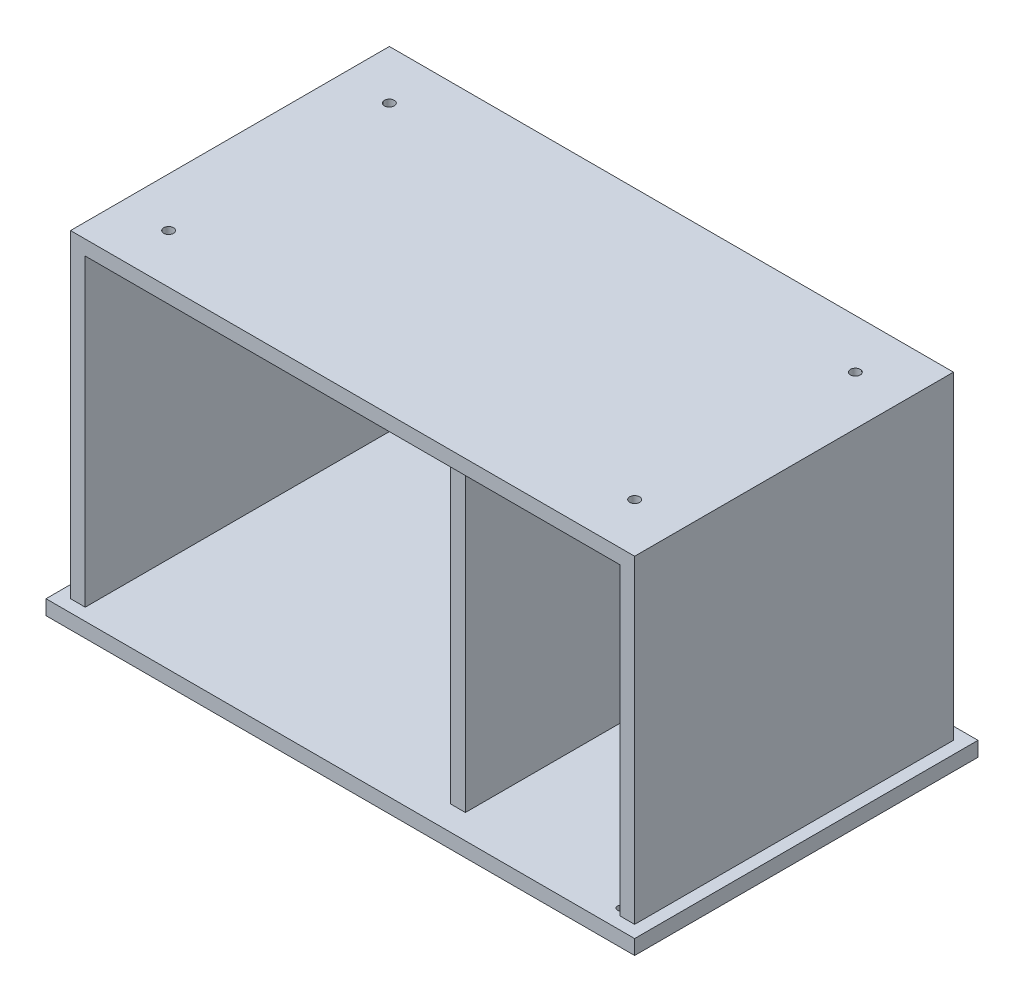
ISO-10303-21;
HEADER;
FILE_DESCRIPTION(('STEP AP214'),'2;1');
FILE_NAME('part.step','',(''),(''),'','','');
FILE_SCHEMA(('AUTOMOTIVE_DESIGN { 1 0 10303 214 1 1 1 1 }'));
ENDSEC;
DATA;
#1=APPLICATION_CONTEXT('core data for automotive mechanical design processes');
#2=APPLICATION_PROTOCOL_DEFINITION('international standard','automotive_design',2000,#1);
#3=PRODUCT_CONTEXT('',#1,'mechanical');
#4=PRODUCT('Part','Part','',(#3));
#5=PRODUCT_RELATED_PRODUCT_CATEGORY('part','',(#4));
#6=PRODUCT_DEFINITION_FORMATION('','',#4);
#7=PRODUCT_DEFINITION_CONTEXT('part definition',#1,'design');
#8=PRODUCT_DEFINITION('design','',#6,#7);
#9=PRODUCT_DEFINITION_SHAPE('','',#8);
#10=(LENGTH_UNIT() NAMED_UNIT(*) SI_UNIT(.MILLI.,.METRE.));
#11=(NAMED_UNIT(*) PLANE_ANGLE_UNIT() SI_UNIT($,.RADIAN.));
#12=(NAMED_UNIT(*) SI_UNIT($,.STERADIAN.) SOLID_ANGLE_UNIT());
#13=UNCERTAINTY_MEASURE_WITH_UNIT(LENGTH_MEASURE(1.E-05),#10,'distance_accuracy_value','');
#14=(GEOMETRIC_REPRESENTATION_CONTEXT(3) GLOBAL_UNCERTAINTY_ASSIGNED_CONTEXT((#13)) GLOBAL_UNIT_ASSIGNED_CONTEXT((#10,
#11,#12)) REPRESENTATION_CONTEXT('',''));
#15=CARTESIAN_POINT('',(0.,0.,0.));
#16=DIRECTION('',(0.,0.,1.));
#17=DIRECTION('',(1.,0.,0.));
#18=AXIS2_PLACEMENT_3D('',#15,#16,#17);
#19=CARTESIAN_POINT('',(0.,15.24,0.));
#20=DIRECTION('',(0.,1.,0.));
#21=DIRECTION('',(0.,0.,1.));
#22=AXIS2_PLACEMENT_3D('',#19,#20,#21);
#23=PLANE('',#22);
#24=CARTESIAN_POINT('',(575.31,15.24,-20.32));
#25=DIRECTION('',(0.,1.,0.));
#26=DIRECTION('',(0.,0.,1.));
#27=AXIS2_PLACEMENT_3D('',#24,#25,#26);
#28=CIRCLE('',#27,3.80999999999999);
#29=CARTESIAN_POINT('',(575.31,15.24,-16.51));
#30=VERTEX_POINT('',#29);
#31=EDGE_CURVE('E174',#30,#30,#28,.T.);
#32=ORIENTED_EDGE('',*,*,#31,.F.);
#33=EDGE_LOOP('',(#32));
#34=FACE_BOUND('',#33,.T.);
#35=DIRECTION('',(0.,0.,1.));
#36=VECTOR('',#35,1.);
#37=CARTESIAN_POINT('',(0.,15.24,-355.6));
#38=LINE('',#37,#36);
#39=CARTESIAN_POINT('',(0.,15.24,-355.6));
#40=VERTEX_POINT('',#39);
#41=CARTESIAN_POINT('',(0.,15.24,0.));
#42=VERTEX_POINT('',#41);
#43=EDGE_CURVE('E267',#40,#42,#38,.T.);
#44=ORIENTED_EDGE('',*,*,#43,.T.);
#45=DIRECTION('',(1.,0.,0.));
#46=VECTOR('',#45,1.);
#47=CARTESIAN_POINT('',(0.,15.24,0.));
#48=LINE('',#47,#46);
#49=CARTESIAN_POINT('',(609.6,15.24,0.));
#50=VERTEX_POINT('',#49);
#51=EDGE_CURVE('E270',#42,#50,#48,.T.);
#52=ORIENTED_EDGE('',*,*,#51,.T.);
#53=DIRECTION('',(0.,0.,-1.));
#54=VECTOR('',#53,1.);
#55=CARTESIAN_POINT('',(609.6,15.24,0.));
#56=LINE('',#55,#54);
#57=CARTESIAN_POINT('',(609.6,15.24,-355.6));
#58=VERTEX_POINT('',#57);
#59=EDGE_CURVE('E273',#50,#58,#56,.T.);
#60=ORIENTED_EDGE('',*,*,#59,.T.);
#61=DIRECTION('',(-1.,0.,0.));
#62=VECTOR('',#61,1.);
#63=CARTESIAN_POINT('',(609.6,15.24,-355.6));
#64=LINE('',#63,#62);
#65=EDGE_CURVE('E275',#58,#40,#64,.T.);
#66=ORIENTED_EDGE('',*,*,#65,.T.);
#67=EDGE_LOOP('',(#44,#52,#60,#66));
#68=FACE_BOUND('',#67,.T.);
#69=DIRECTION('',(0.,0.,1.));
#70=VECTOR('',#69,1.);
#71=CARTESIAN_POINT('',(581.66,15.24,-342.9));
#72=LINE('',#71,#70);
#73=CARTESIAN_POINT('',(581.66,15.24,-330.2));
#74=VERTEX_POINT('',#73);
#75=CARTESIAN_POINT('',(581.66,15.24,-12.7));
#76=VERTEX_POINT('',#75);
#77=EDGE_CURVE('E155',#74,#76,#72,.T.);
#78=ORIENTED_EDGE('',*,*,#77,.F.);
#79=DIRECTION('',(-1.,0.,0.));
#80=VECTOR('',#79,1.);
#81=CARTESIAN_POINT('',(12.7,15.24,-330.2));
#82=LINE('',#81,#80);
#83=CARTESIAN_POINT('',(408.94,15.24,-330.2));
#84=VERTEX_POINT('',#83);
#85=EDGE_CURVE('E165',#74,#84,#82,.T.);
#86=ORIENTED_EDGE('',*,*,#85,.T.);
#87=DIRECTION('',(0.,0.,1.));
#88=VECTOR('',#87,1.);
#89=CARTESIAN_POINT('',(408.94,15.24,-342.9));
#90=LINE('',#89,#88);
#91=CARTESIAN_POINT('',(408.94,15.24,-25.4));
#92=VERTEX_POINT('',#91);
#93=EDGE_CURVE('E199',#84,#92,#90,.T.);
#94=ORIENTED_EDGE('',*,*,#93,.T.);
#95=DIRECTION('',(1.,0.,0.));
#96=VECTOR('',#95,1.);
#97=CARTESIAN_POINT('',(408.94,15.24,-25.4));
#98=LINE('',#97,#96);
#99=CARTESIAN_POINT('',(393.7,15.24,-25.4));
#100=VERTEX_POINT('',#99);
#101=EDGE_CURVE('E185',#100,#92,#98,.T.);
#102=ORIENTED_EDGE('',*,*,#101,.F.);
#103=DIRECTION('',(0.,0.,1.));
#104=VECTOR('',#103,1.);
#105=CARTESIAN_POINT('',(393.7,15.24,-342.9));
#106=LINE('',#105,#104);
#107=CARTESIAN_POINT('',(393.7,15.24,-330.2));
#108=VERTEX_POINT('',#107);
#109=EDGE_CURVE('E210',#108,#100,#106,.T.);
#110=ORIENTED_EDGE('',*,*,#109,.F.);
#111=CARTESIAN_POINT('',(27.9400000000001,15.24,-330.2));
#112=VERTEX_POINT('',#111);
#113=EDGE_CURVE('E47',#108,#112,#82,.T.);
#114=ORIENTED_EDGE('',*,*,#113,.T.);
#115=DIRECTION('',(0.,0.,1.));
#116=VECTOR('',#115,1.);
#117=CARTESIAN_POINT('',(27.9400000000001,15.24,-342.9));
#118=LINE('',#117,#116);
#119=CARTESIAN_POINT('',(27.9400000000001,15.24,-12.7));
#120=VERTEX_POINT('',#119);
#121=EDGE_CURVE('E206',#112,#120,#118,.T.);
#122=ORIENTED_EDGE('',*,*,#121,.T.);
#123=DIRECTION('',(1.,0.,0.));
#124=VECTOR('',#123,1.);
#125=CARTESIAN_POINT('',(12.7000000000001,15.24,-12.7));
#126=LINE('',#125,#124);
#127=CARTESIAN_POINT('',(12.7000000000001,15.24,-12.7));
#128=VERTEX_POINT('',#127);
#129=EDGE_CURVE('E216',#128,#120,#126,.T.);
#130=ORIENTED_EDGE('',*,*,#129,.F.);
#131=DIRECTION('',(0.,0.,1.));
#132=VECTOR('',#131,1.);
#133=CARTESIAN_POINT('',(12.7,15.24,-342.9));
#134=LINE('',#133,#132);
#135=CARTESIAN_POINT('',(12.7,15.24,-342.9));
#136=VERTEX_POINT('',#135);
#137=EDGE_CURVE('E226',#136,#128,#134,.T.);
#138=ORIENTED_EDGE('',*,*,#137,.F.);
#139=DIRECTION('',(-1.,0.,0.));
#140=VECTOR('',#139,1.);
#141=CARTESIAN_POINT('',(12.7,15.24,-342.9));
#142=LINE('',#141,#140);
#143=CARTESIAN_POINT('',(596.9,15.24,-342.9));
#144=VERTEX_POINT('',#143);
#145=EDGE_CURVE('E224',#144,#136,#142,.T.);
#146=ORIENTED_EDGE('',*,*,#145,.F.);
#147=DIRECTION('',(0.,0.,-1.));
#148=VECTOR('',#147,1.);
#149=CARTESIAN_POINT('',(596.9,15.24,-342.9));
#150=LINE('',#149,#148);
#151=CARTESIAN_POINT('',(596.9,15.24,-12.7));
#152=VERTEX_POINT('',#151);
#153=EDGE_CURVE('E200',#152,#144,#150,.T.);
#154=ORIENTED_EDGE('',*,*,#153,.F.);
#155=EDGE_CURVE('E228',#76,#152,#126,.T.);
#156=ORIENTED_EDGE('',*,*,#155,.F.);
#157=EDGE_LOOP('',(#78,#86,#94,#102,#110,#114,#122,#130,#138,#146,#154,#156));
#158=FACE_BOUND('',#157,.T.);
#159=ADVANCED_FACE('F32',(#34,#68,#158),#23,.T.);
#160=CARTESIAN_POINT('',(27.9400000000001,330.2,-342.9));
#161=DIRECTION('',(-1.,0.,0.));
#162=DIRECTION('',(0.,-1.,0.));
#163=AXIS2_PLACEMENT_3D('',#160,#161,#162);
#164=PLANE('',#163);
#165=DIRECTION('',(0.,-1.,0.));
#166=VECTOR('',#165,1.);
#167=CARTESIAN_POINT('',(27.9400000000001,330.2,-330.2));
#168=LINE('',#167,#166);
#169=CARTESIAN_POINT('',(27.9400000000001,330.2,-330.2));
#170=VERTEX_POINT('',#169);
#171=EDGE_CURVE('E179',#170,#112,#168,.T.);
#172=ORIENTED_EDGE('',*,*,#171,.F.);
#173=DIRECTION('',(0.,0.,1.));
#174=VECTOR('',#173,1.);
#175=CARTESIAN_POINT('',(27.9400000000001,330.2,-342.9));
#176=LINE('',#175,#174);
#177=CARTESIAN_POINT('',(27.9400000000001,330.2,-12.7));
#178=VERTEX_POINT('',#177);
#179=EDGE_CURVE('E197',#170,#178,#176,.T.);
#180=ORIENTED_EDGE('',*,*,#179,.T.);
#181=DIRECTION('',(0.,-1.,0.));
#182=VECTOR('',#181,1.);
#183=CARTESIAN_POINT('',(27.9400000000001,330.2,-12.7));
#184=LINE('',#183,#182);
#185=EDGE_CURVE('E194',#178,#120,#184,.T.);
#186=ORIENTED_EDGE('',*,*,#185,.T.);
#187=ORIENTED_EDGE('',*,*,#121,.F.);
#188=EDGE_LOOP('',(#172,#180,#186,#187));
#189=FACE_BOUND('',#188,.T.);
#190=ADVANCED_FACE('F314',(#189),#164,.F.);
#191=CARTESIAN_POINT('',(393.7,330.2,-342.9));
#192=DIRECTION('',(1.,0.,0.));
#193=DIRECTION('',(0.,1.,0.));
#194=AXIS2_PLACEMENT_3D('',#191,#192,#193);
#195=PLANE('',#194);
#196=DIRECTION('',(0.,1.,0.));
#197=VECTOR('',#196,1.);
#198=CARTESIAN_POINT('',(393.7,330.2,-330.2));
#199=LINE('',#198,#197);
#200=CARTESIAN_POINT('',(393.7,330.2,-330.2));
#201=VERTEX_POINT('',#200);
#202=EDGE_CURVE('E55',#108,#201,#199,.T.);
#203=ORIENTED_EDGE('',*,*,#202,.F.);
#204=ORIENTED_EDGE('',*,*,#109,.T.);
#205=DIRECTION('',(0.,-1.,0.));
#206=VECTOR('',#205,1.);
#207=CARTESIAN_POINT('',(393.7,15.24,-25.4));
#208=LINE('',#207,#206);
#209=CARTESIAN_POINT('',(393.7,330.2,-25.4));
#210=VERTEX_POINT('',#209);
#211=EDGE_CURVE('E182',#210,#100,#208,.T.);
#212=ORIENTED_EDGE('',*,*,#211,.F.);
#213=DIRECTION('',(0.,0.,1.));
#214=VECTOR('',#213,1.);
#215=CARTESIAN_POINT('',(393.7,330.2,-342.9));
#216=LINE('',#215,#214);
#217=EDGE_CURVE('E208',#201,#210,#216,.T.);
#218=ORIENTED_EDGE('',*,*,#217,.F.);
#219=EDGE_LOOP('',(#203,#204,#212,#218));
#220=FACE_BOUND('',#219,.T.);
#221=ADVANCED_FACE('F353',(#220),#195,.F.);
#222=CARTESIAN_POINT('',(408.94,15.24,-342.9));
#223=DIRECTION('',(-1.,0.,0.));
#224=DIRECTION('',(0.,0.,1.));
#225=AXIS2_PLACEMENT_3D('',#222,#223,#224);
#226=PLANE('',#225);
#227=DIRECTION('',(0.,-1.,0.));
#228=VECTOR('',#227,1.);
#229=CARTESIAN_POINT('',(408.94,15.24,-330.2));
#230=LINE('',#229,#228);
#231=CARTESIAN_POINT('',(408.94,330.2,-330.2));
#232=VERTEX_POINT('',#231);
#233=EDGE_CURVE('E164',#232,#84,#230,.T.);
#234=ORIENTED_EDGE('',*,*,#233,.F.);
#235=DIRECTION('',(0.,0.,1.));
#236=VECTOR('',#235,1.);
#237=CARTESIAN_POINT('',(408.94,330.2,-342.9));
#238=LINE('',#237,#236);
#239=CARTESIAN_POINT('',(408.94,330.2,-25.4));
#240=VERTEX_POINT('',#239);
#241=EDGE_CURVE('E154',#232,#240,#238,.T.);
#242=ORIENTED_EDGE('',*,*,#241,.T.);
#243=DIRECTION('',(0.,1.,0.));
#244=VECTOR('',#243,1.);
#245=CARTESIAN_POINT('',(408.94,330.2,-25.4));
#246=LINE('',#245,#244);
#247=EDGE_CURVE('E188',#92,#240,#246,.T.);
#248=ORIENTED_EDGE('',*,*,#247,.F.);
#249=ORIENTED_EDGE('',*,*,#93,.F.);
#250=EDGE_LOOP('',(#234,#242,#248,#249));
#251=FACE_BOUND('',#250,.T.);
#252=ADVANCED_FACE('F347',(#251),#226,.F.);
#253=CARTESIAN_POINT('',(408.94,330.2,-342.9));
#254=DIRECTION('',(0.,1.,0.));
#255=DIRECTION('',(0.,0.,1.));
#256=AXIS2_PLACEMENT_3D('',#253,#254,#255);
#257=PLANE('',#256);
#258=CARTESIAN_POINT('',(575.31,330.2,-20.32));
#259=DIRECTION('',(0.,-1.,0.));
#260=DIRECTION('',(0.,0.,-1.));
#261=AXIS2_PLACEMENT_3D('',#258,#259,#260);
#262=CIRCLE('',#261,3.80999999999999);
#263=CARTESIAN_POINT('',(575.31,330.2,-24.13));
#264=VERTEX_POINT('',#263);
#265=EDGE_CURVE('E588',#264,#264,#262,.T.);
#266=ORIENTED_EDGE('',*,*,#265,.F.);
#267=EDGE_LOOP('',(#266));
#268=FACE_BOUND('',#267,.T.);
#269=DIRECTION('',(-1.,0.,0.));
#270=VECTOR('',#269,1.);
#271=CARTESIAN_POINT('',(408.94,330.2,-330.2));
#272=LINE('',#271,#270);
#273=CARTESIAN_POINT('',(581.66,330.2,-330.2));
#274=VERTEX_POINT('',#273);
#275=EDGE_CURVE('E159',#274,#232,#272,.T.);
#276=ORIENTED_EDGE('',*,*,#275,.F.);
#277=DIRECTION('',(0.,0.,1.));
#278=VECTOR('',#277,1.);
#279=CARTESIAN_POINT('',(581.66,330.2,-342.9));
#280=LINE('',#279,#278);
#281=CARTESIAN_POINT('',(581.66,330.2,-12.7));
#282=VERTEX_POINT('',#281);
#283=EDGE_CURVE('E145',#274,#282,#280,.T.);
#284=ORIENTED_EDGE('',*,*,#283,.T.);
#285=DIRECTION('',(-1.,0.,0.));
#286=VECTOR('',#285,1.);
#287=CARTESIAN_POINT('',(408.94,330.2,-12.7));
#288=LINE('',#287,#286);
#289=EDGE_CURVE('E196',#282,#178,#288,.T.);
#290=ORIENTED_EDGE('',*,*,#289,.T.);
#291=ORIENTED_EDGE('',*,*,#179,.F.);
#292=EDGE_CURVE('E167',#201,#170,#272,.T.);
#293=ORIENTED_EDGE('',*,*,#292,.F.);
#294=ORIENTED_EDGE('',*,*,#217,.T.);
#295=DIRECTION('',(-1.,0.,0.));
#296=VECTOR('',#295,1.);
#297=CARTESIAN_POINT('',(393.7,330.2,-25.4));
#298=LINE('',#297,#296);
#299=EDGE_CURVE('E191',#240,#210,#298,.T.);
#300=ORIENTED_EDGE('',*,*,#299,.F.);
#301=ORIENTED_EDGE('',*,*,#241,.F.);
#302=EDGE_LOOP('',(#276,#284,#290,#291,#293,#294,#300,#301));
#303=FACE_BOUND('',#302,.T.);
#304=ADVANCED_FACE('F160',(#268,#303),#257,.F.);
#305=CARTESIAN_POINT('',(581.66,15.24,-342.9));
#306=DIRECTION('',(1.,0.,0.));
#307=DIRECTION('',(0.,0.,-1.));
#308=AXIS2_PLACEMENT_3D('',#305,#306,#307);
#309=PLANE('',#308);
#310=DIRECTION('',(0.,1.,0.));
#311=VECTOR('',#310,1.);
#312=CARTESIAN_POINT('',(581.66,15.24,-330.2));
#313=LINE('',#312,#311);
#314=EDGE_CURVE('E11',#74,#274,#313,.T.);
#315=ORIENTED_EDGE('',*,*,#314,.F.);
#316=ORIENTED_EDGE('',*,*,#77,.T.);
#317=DIRECTION('',(0.,1.,0.));
#318=VECTOR('',#317,1.);
#319=CARTESIAN_POINT('',(581.66,15.24,-12.7));
#320=LINE('',#319,#318);
#321=EDGE_CURVE('E150',#76,#282,#320,.T.);
#322=ORIENTED_EDGE('',*,*,#321,.T.);
#323=ORIENTED_EDGE('',*,*,#283,.F.);
#324=EDGE_LOOP('',(#315,#316,#322,#323));
#325=FACE_BOUND('',#324,.T.);
#326=ADVANCED_FACE('F147',(#325),#309,.F.);
#327=CARTESIAN_POINT('',(0.,15.24,-355.6));
#328=DIRECTION('',(1.,0.,0.));
#329=DIRECTION('',(0.,0.,-1.));
#330=AXIS2_PLACEMENT_3D('',#327,#328,#329);
#331=PLANE('',#330);
#332=DIRECTION('',(0.,0.,1.));
#333=VECTOR('',#332,1.);
#334=CARTESIAN_POINT('',(0.,0.,-355.6));
#335=LINE('',#334,#333);
#336=CARTESIAN_POINT('',(0.,0.,-355.6));
#337=VERTEX_POINT('',#336);
#338=CARTESIAN_POINT('',(0.,0.,0.));
#339=VERTEX_POINT('',#338);
#340=EDGE_CURVE('E264',#337,#339,#335,.T.);
#341=ORIENTED_EDGE('',*,*,#340,.T.);
#342=DIRECTION('',(0.,-1.,0.));
#343=VECTOR('',#342,1.);
#344=CARTESIAN_POINT('',(0.,15.24,0.));
#345=LINE('',#344,#343);
#346=EDGE_CURVE('E40',#42,#339,#345,.T.);
#347=ORIENTED_EDGE('',*,*,#346,.F.);
#348=ORIENTED_EDGE('',*,*,#43,.F.);
#349=DIRECTION('',(0.,-1.,0.));
#350=VECTOR('',#349,1.);
#351=CARTESIAN_POINT('',(0.,15.24,-355.6));
#352=LINE('',#351,#350);
#353=EDGE_CURVE('E277',#40,#337,#352,.T.);
#354=ORIENTED_EDGE('',*,*,#353,.T.);
#355=EDGE_LOOP('',(#341,#347,#348,#354));
#356=FACE_BOUND('',#355,.T.);
#357=ADVANCED_FACE('F34',(#356),#331,.F.);
#358=CARTESIAN_POINT('',(0.,15.24,0.));
#359=DIRECTION('',(0.,0.,-1.));
#360=DIRECTION('',(-1.,0.,0.));
#361=AXIS2_PLACEMENT_3D('',#358,#359,#360);
#362=PLANE('',#361);
#363=DIRECTION('',(1.,0.,0.));
#364=VECTOR('',#363,1.);
#365=CARTESIAN_POINT('',(0.,0.,0.));
#366=LINE('',#365,#364);
#367=CARTESIAN_POINT('',(609.6,0.,0.));
#368=VERTEX_POINT('',#367);
#369=EDGE_CURVE('E280',#339,#368,#366,.T.);
#370=ORIENTED_EDGE('',*,*,#369,.T.);
#371=DIRECTION('',(0.,-1.,0.));
#372=VECTOR('',#371,1.);
#373=CARTESIAN_POINT('',(609.6,15.24,0.));
#374=LINE('',#373,#372);
#375=EDGE_CURVE('E290',#50,#368,#374,.T.);
#376=ORIENTED_EDGE('',*,*,#375,.F.);
#377=ORIENTED_EDGE('',*,*,#51,.F.);
#378=ORIENTED_EDGE('',*,*,#346,.T.);
#379=EDGE_LOOP('',(#370,#376,#377,#378));
#380=FACE_BOUND('',#379,.T.);
#381=ADVANCED_FACE('F295',(#380),#362,.F.);
#382=CARTESIAN_POINT('',(609.6,15.24,0.));
#383=DIRECTION('',(-1.,0.,0.));
#384=DIRECTION('',(0.,0.,1.));
#385=AXIS2_PLACEMENT_3D('',#382,#383,#384);
#386=PLANE('',#385);
#387=DIRECTION('',(0.,0.,-1.));
#388=VECTOR('',#387,1.);
#389=CARTESIAN_POINT('',(609.6,0.,0.));
#390=LINE('',#389,#388);
#391=CARTESIAN_POINT('',(609.6,0.,-355.6));
#392=VERTEX_POINT('',#391);
#393=EDGE_CURVE('E282',#368,#392,#390,.T.);
#394=ORIENTED_EDGE('',*,*,#393,.T.);
#395=DIRECTION('',(0.,-1.,0.));
#396=VECTOR('',#395,1.);
#397=CARTESIAN_POINT('',(609.6,15.24,-355.6));
#398=LINE('',#397,#396);
#399=EDGE_CURVE('E287',#58,#392,#398,.T.);
#400=ORIENTED_EDGE('',*,*,#399,.F.);
#401=ORIENTED_EDGE('',*,*,#59,.F.);
#402=ORIENTED_EDGE('',*,*,#375,.T.);
#403=EDGE_LOOP('',(#394,#400,#401,#402));
#404=FACE_BOUND('',#403,.T.);
#405=ADVANCED_FACE('F307',(#404),#386,.F.);
#406=CARTESIAN_POINT('',(609.6,15.24,-355.6));
#407=DIRECTION('',(0.,0.,1.));
#408=DIRECTION('',(1.,0.,0.));
#409=AXIS2_PLACEMENT_3D('',#406,#407,#408);
#410=PLANE('',#409);
#411=DIRECTION('',(-1.,0.,0.));
#412=VECTOR('',#411,1.);
#413=CARTESIAN_POINT('',(609.6,0.,-355.6));
#414=LINE('',#413,#412);
#415=EDGE_CURVE('E271',#392,#337,#414,.T.);
#416=ORIENTED_EDGE('',*,*,#415,.T.);
#417=ORIENTED_EDGE('',*,*,#353,.F.);
#418=ORIENTED_EDGE('',*,*,#65,.F.);
#419=ORIENTED_EDGE('',*,*,#399,.T.);
#420=EDGE_LOOP('',(#416,#417,#418,#419));
#421=FACE_BOUND('',#420,.T.);
#422=ADVANCED_FACE('F311',(#421),#410,.F.);
#423=CARTESIAN_POINT('',(0.,0.,0.));
#424=DIRECTION('',(0.,1.,0.));
#425=DIRECTION('',(0.,0.,1.));
#426=AXIS2_PLACEMENT_3D('',#423,#424,#425);
#427=PLANE('',#426);
#428=CARTESIAN_POINT('',(558.8,0.,-304.8));
#429=DIRECTION('',(0.,-1.,0.));
#430=DIRECTION('',(0.,0.,-1.));
#431=AXIS2_PLACEMENT_3D('',#428,#429,#430);
#432=CIRCLE('',#431,15.2400000000001);
#433=CARTESIAN_POINT('',(558.8,0.,-320.04));
#434=VERTEX_POINT('',#433);
#435=EDGE_CURVE('E253',#434,#434,#432,.T.);
#436=ORIENTED_EDGE('',*,*,#435,.F.);
#437=EDGE_LOOP('',(#436));
#438=FACE_BOUND('',#437,.T.);
#439=CARTESIAN_POINT('',(50.7999999999998,0.,-50.8000000000003));
#440=DIRECTION('',(0.,-1.,0.));
#441=DIRECTION('',(0.,0.,1.));
#442=AXIS2_PLACEMENT_3D('',#439,#440,#441);
#443=CIRCLE('',#442,15.24);
#444=CARTESIAN_POINT('',(50.7999999999998,0.,-35.5600000000003));
#445=VERTEX_POINT('',#444);
#446=EDGE_CURVE('E246',#445,#445,#443,.T.);
#447=ORIENTED_EDGE('',*,*,#446,.F.);
#448=EDGE_LOOP('',(#447));
#449=FACE_BOUND('',#448,.T.);
#450=CARTESIAN_POINT('',(50.8000000000001,0.,-304.8));
#451=DIRECTION('',(0.,-1.,0.));
#452=DIRECTION('',(0.,0.,1.));
#453=AXIS2_PLACEMENT_3D('',#450,#451,#452);
#454=CIRCLE('',#453,15.2400000000001);
#455=CARTESIAN_POINT('',(50.8000000000001,0.,-289.56));
#456=VERTEX_POINT('',#455);
#457=EDGE_CURVE('E242',#456,#456,#454,.T.);
#458=ORIENTED_EDGE('',*,*,#457,.F.);
#459=EDGE_LOOP('',(#458));
#460=FACE_BOUND('',#459,.T.);
#461=CARTESIAN_POINT('',(558.8,0.,-50.8));
#462=DIRECTION('',(0.,-1.,0.));
#463=DIRECTION('',(0.,0.,-1.));
#464=AXIS2_PLACEMENT_3D('',#461,#462,#463);
#465=CIRCLE('',#464,15.2400000000001);
#466=CARTESIAN_POINT('',(558.8,0.,-66.0400000000001));
#467=VERTEX_POINT('',#466);
#468=EDGE_CURVE('E252',#467,#467,#465,.T.);
#469=ORIENTED_EDGE('',*,*,#468,.F.);
#470=EDGE_LOOP('',(#469));
#471=FACE_BOUND('',#470,.T.);
#472=ORIENTED_EDGE('',*,*,#340,.F.);
#473=ORIENTED_EDGE('',*,*,#415,.F.);
#474=ORIENTED_EDGE('',*,*,#393,.F.);
#475=ORIENTED_EDGE('',*,*,#369,.F.);
#476=EDGE_LOOP('',(#472,#473,#474,#475));
#477=FACE_BOUND('',#476,.T.);
#478=ADVANCED_FACE('F303',(#438,#449,#460,#471,#477),#427,.F.);
#479=CARTESIAN_POINT('',(558.8,3.81,-50.8));
#480=DIRECTION('',(0.,-1.,0.));
#481=DIRECTION('',(0.,0.,-1.));
#482=AXIS2_PLACEMENT_3D('',#479,#480,#481);
#483=CYLINDRICAL_SURFACE('',#482,15.2400000000001);
#484=CARTESIAN_POINT('',(558.8,3.81,-50.8));
#485=DIRECTION('',(0.,-1.,0.));
#486=DIRECTION('',(0.,0.,-1.));
#487=AXIS2_PLACEMENT_3D('',#484,#485,#486);
#488=CIRCLE('',#487,15.2400000000001);
#489=CARTESIAN_POINT('',(558.8,3.81,-66.0400000000001));
#490=VERTEX_POINT('',#489);
#491=EDGE_CURVE('E261',#490,#490,#488,.T.);
#492=ORIENTED_EDGE('',*,*,#491,.F.);
#493=EDGE_LOOP('',(#492));
#494=FACE_BOUND('',#493,.T.);
#495=ORIENTED_EDGE('',*,*,#468,.T.);
#496=EDGE_LOOP('',(#495));
#497=FACE_BOUND('',#496,.T.);
#498=ADVANCED_FACE('F403',(#494,#497),#483,.F.);
#499=CARTESIAN_POINT('',(558.8,3.81,-50.8));
#500=DIRECTION('',(0.,-1.,0.));
#501=DIRECTION('',(0.,0.,-1.));
#502=AXIS2_PLACEMENT_3D('',#499,#500,#501);
#503=PLANE('',#502);
#504=ORIENTED_EDGE('',*,*,#491,.T.);
#505=EDGE_LOOP('',(#504));
#506=FACE_BOUND('',#505,.T.);
#507=ADVANCED_FACE('F385',(#506),#503,.T.);
#508=CARTESIAN_POINT('',(50.8000000000001,3.81,-304.8));
#509=DIRECTION('',(0.,-1.,0.));
#510=DIRECTION('',(0.,0.,-1.));
#511=AXIS2_PLACEMENT_3D('',#508,#509,#510);
#512=CYLINDRICAL_SURFACE('',#511,15.2400000000001);
#513=CARTESIAN_POINT('',(50.8000000000001,3.81,-304.8));
#514=DIRECTION('',(0.,-1.,0.));
#515=DIRECTION('',(0.,0.,1.));
#516=AXIS2_PLACEMENT_3D('',#513,#514,#515);
#517=CIRCLE('',#516,15.2400000000001);
#518=CARTESIAN_POINT('',(50.8000000000001,3.81,-289.56));
#519=VERTEX_POINT('',#518);
#520=EDGE_CURVE('E243',#519,#519,#517,.T.);
#521=ORIENTED_EDGE('',*,*,#520,.F.);
#522=EDGE_LOOP('',(#521));
#523=FACE_BOUND('',#522,.T.);
#524=ORIENTED_EDGE('',*,*,#457,.T.);
#525=EDGE_LOOP('',(#524));
#526=FACE_BOUND('',#525,.T.);
#527=ADVANCED_FACE('F381',(#523,#526),#512,.F.);
#528=CARTESIAN_POINT('',(50.8000000000001,3.81,-304.8));
#529=DIRECTION('',(0.,1.,0.));
#530=DIRECTION('',(0.,0.,1.));
#531=AXIS2_PLACEMENT_3D('',#528,#529,#530);
#532=PLANE('',#531);
#533=ORIENTED_EDGE('',*,*,#520,.T.);
#534=EDGE_LOOP('',(#533));
#535=FACE_BOUND('',#534,.T.);
#536=ADVANCED_FACE('F377',(#535),#532,.F.);
#537=CARTESIAN_POINT('',(50.7999999999998,3.81,-50.8000000000003));
#538=DIRECTION('',(0.,-1.,0.));
#539=DIRECTION('',(0.,0.,-1.));
#540=AXIS2_PLACEMENT_3D('',#537,#538,#539);
#541=CYLINDRICAL_SURFACE('',#540,15.24);
#542=CARTESIAN_POINT('',(50.7999999999998,3.81,-50.8000000000003));
#543=DIRECTION('',(0.,-1.,0.));
#544=DIRECTION('',(0.,0.,1.));
#545=AXIS2_PLACEMENT_3D('',#542,#543,#544);
#546=CIRCLE('',#545,15.24);
#547=CARTESIAN_POINT('',(50.7999999999998,3.81,-35.5600000000003));
#548=VERTEX_POINT('',#547);
#549=EDGE_CURVE('E256',#548,#548,#546,.T.);
#550=ORIENTED_EDGE('',*,*,#549,.F.);
#551=EDGE_LOOP('',(#550));
#552=FACE_BOUND('',#551,.T.);
#553=ORIENTED_EDGE('',*,*,#446,.T.);
#554=EDGE_LOOP('',(#553));
#555=FACE_BOUND('',#554,.T.);
#556=ADVANCED_FACE('F380',(#552,#555),#541,.F.);
#557=CARTESIAN_POINT('',(50.7999999999998,3.81,-50.8000000000003));
#558=DIRECTION('',(0.,1.,0.));
#559=DIRECTION('',(0.,0.,1.));
#560=AXIS2_PLACEMENT_3D('',#557,#558,#559);
#561=PLANE('',#560);
#562=ORIENTED_EDGE('',*,*,#549,.T.);
#563=EDGE_LOOP('',(#562));
#564=FACE_BOUND('',#563,.T.);
#565=ADVANCED_FACE('F393',(#564),#561,.F.);
#566=CARTESIAN_POINT('',(558.8,3.81,-304.8));
#567=DIRECTION('',(0.,-1.,0.));
#568=DIRECTION('',(0.,0.,-1.));
#569=AXIS2_PLACEMENT_3D('',#566,#567,#568);
#570=CYLINDRICAL_SURFACE('',#569,15.2400000000001);
#571=CARTESIAN_POINT('',(558.8,3.81,-304.8));
#572=DIRECTION('',(0.,-1.,0.));
#573=DIRECTION('',(0.,0.,-1.));
#574=AXIS2_PLACEMENT_3D('',#571,#572,#573);
#575=CIRCLE('',#574,15.2400000000001);
#576=CARTESIAN_POINT('',(558.8,3.81,-320.04));
#577=VERTEX_POINT('',#576);
#578=EDGE_CURVE('E249',#577,#577,#575,.T.);
#579=ORIENTED_EDGE('',*,*,#578,.F.);
#580=EDGE_LOOP('',(#579));
#581=FACE_BOUND('',#580,.T.);
#582=ORIENTED_EDGE('',*,*,#435,.T.);
#583=EDGE_LOOP('',(#582));
#584=FACE_BOUND('',#583,.T.);
#585=ADVANCED_FACE('F389',(#581,#584),#570,.F.);
#586=CARTESIAN_POINT('',(558.8,3.81,-304.8));
#587=DIRECTION('',(0.,-1.,0.));
#588=DIRECTION('',(0.,0.,-1.));
#589=AXIS2_PLACEMENT_3D('',#586,#587,#588);
#590=PLANE('',#589);
#591=ORIENTED_EDGE('',*,*,#578,.T.);
#592=EDGE_LOOP('',(#591));
#593=FACE_BOUND('',#592,.T.);
#594=ADVANCED_FACE('F375',(#593),#590,.T.);
#595=CARTESIAN_POINT('',(596.9,345.44,-342.9));
#596=DIRECTION('',(-1.,0.,0.));
#597=DIRECTION('',(0.,0.,1.));
#598=AXIS2_PLACEMENT_3D('',#595,#596,#597);
#599=PLANE('',#598);
#600=DIRECTION('',(0.,-1.,0.));
#601=VECTOR('',#600,1.);
#602=CARTESIAN_POINT('',(596.9,345.44,-342.9));
#603=LINE('',#602,#601);
#604=CARTESIAN_POINT('',(596.9,345.44,-342.9));
#605=VERTEX_POINT('',#604);
#606=EDGE_CURVE('E239',#605,#144,#603,.T.);
#607=ORIENTED_EDGE('',*,*,#606,.F.);
#608=DIRECTION('',(0.,0.,-1.));
#609=VECTOR('',#608,1.);
#610=CARTESIAN_POINT('',(596.9,345.44,-342.9));
#611=LINE('',#610,#609);
#612=CARTESIAN_POINT('',(596.9,345.44,-12.7));
#613=VERTEX_POINT('',#612);
#614=EDGE_CURVE('E213',#613,#605,#611,.T.);
#615=ORIENTED_EDGE('',*,*,#614,.F.);
#616=DIRECTION('',(0.,-1.,0.));
#617=VECTOR('',#616,1.);
#618=CARTESIAN_POINT('',(596.9,345.44,-12.7));
#619=LINE('',#618,#617);
#620=EDGE_CURVE('E222',#613,#152,#619,.T.);
#621=ORIENTED_EDGE('',*,*,#620,.T.);
#622=ORIENTED_EDGE('',*,*,#153,.T.);
#623=EDGE_LOOP('',(#607,#615,#621,#622));
#624=FACE_BOUND('',#623,.T.);
#625=ADVANCED_FACE('F371',(#624),#599,.F.);
#626=CARTESIAN_POINT('',(12.7,345.44,-342.9));
#627=DIRECTION('',(0.,0.,1.));
#628=DIRECTION('',(1.,0.,0.));
#629=AXIS2_PLACEMENT_3D('',#626,#627,#628);
#630=PLANE('',#629);
#631=ORIENTED_EDGE('',*,*,#145,.T.);
#632=DIRECTION('',(0.,-1.,0.));
#633=VECTOR('',#632,1.);
#634=CARTESIAN_POINT('',(12.7,345.44,-342.9));
#635=LINE('',#634,#633);
#636=CARTESIAN_POINT('',(12.7,345.44,-342.9));
#637=VERTEX_POINT('',#636);
#638=EDGE_CURVE('E236',#637,#136,#635,.T.);
#639=ORIENTED_EDGE('',*,*,#638,.F.);
#640=DIRECTION('',(-1.,0.,0.));
#641=VECTOR('',#640,1.);
#642=CARTESIAN_POINT('',(12.7,345.44,-342.9));
#643=LINE('',#642,#641);
#644=EDGE_CURVE('E215',#605,#637,#643,.T.);
#645=ORIENTED_EDGE('',*,*,#644,.F.);
#646=ORIENTED_EDGE('',*,*,#606,.T.);
#647=EDGE_LOOP('',(#631,#639,#645,#646));
#648=FACE_BOUND('',#647,.T.);
#649=ADVANCED_FACE('F367',(#648),#630,.F.);
#650=CARTESIAN_POINT('',(12.7,345.44,-342.9));
#651=DIRECTION('',(1.,0.,0.));
#652=DIRECTION('',(0.,0.,-1.));
#653=AXIS2_PLACEMENT_3D('',#650,#651,#652);
#654=PLANE('',#653);
#655=ORIENTED_EDGE('',*,*,#137,.T.);
#656=DIRECTION('',(0.,-1.,0.));
#657=VECTOR('',#656,1.);
#658=CARTESIAN_POINT('',(12.7000000000001,345.44,-12.7));
#659=LINE('',#658,#657);
#660=CARTESIAN_POINT('',(12.7000000000001,345.44,-12.7));
#661=VERTEX_POINT('',#660);
#662=EDGE_CURVE('E233',#661,#128,#659,.T.);
#663=ORIENTED_EDGE('',*,*,#662,.F.);
#664=DIRECTION('',(0.,0.,1.));
#665=VECTOR('',#664,1.);
#666=CARTESIAN_POINT('',(12.7,345.44,-342.9));
#667=LINE('',#666,#665);
#668=EDGE_CURVE('E218',#637,#661,#667,.T.);
#669=ORIENTED_EDGE('',*,*,#668,.F.);
#670=ORIENTED_EDGE('',*,*,#638,.T.);
#671=EDGE_LOOP('',(#655,#663,#669,#670));
#672=FACE_BOUND('',#671,.T.);
#673=ADVANCED_FACE('F364',(#672),#654,.F.);
#674=CARTESIAN_POINT('',(12.7000000000001,345.44,-12.7));
#675=DIRECTION('',(0.,0.,-1.));
#676=DIRECTION('',(-1.,0.,0.));
#677=AXIS2_PLACEMENT_3D('',#674,#675,#676);
#678=PLANE('',#677);
#679=ORIENTED_EDGE('',*,*,#185,.F.);
#680=ORIENTED_EDGE('',*,*,#289,.F.);
#681=ORIENTED_EDGE('',*,*,#321,.F.);
#682=ORIENTED_EDGE('',*,*,#155,.T.);
#683=ORIENTED_EDGE('',*,*,#620,.F.);
#684=DIRECTION('',(1.,0.,0.));
#685=VECTOR('',#684,1.);
#686=CARTESIAN_POINT('',(12.7000000000001,345.44,-12.7));
#687=LINE('',#686,#685);
#688=EDGE_CURVE('E220',#661,#613,#687,.T.);
#689=ORIENTED_EDGE('',*,*,#688,.F.);
#690=ORIENTED_EDGE('',*,*,#662,.T.);
#691=ORIENTED_EDGE('',*,*,#129,.T.);
#692=EDGE_LOOP('',(#679,#680,#681,#682,#683,#689,#690,#691));
#693=FACE_BOUND('',#692,.T.);
#694=ADVANCED_FACE('F321',(#693),#678,.F.);
#695=CARTESIAN_POINT('',(0.,345.44,0.));
#696=DIRECTION('',(0.,1.,0.));
#697=DIRECTION('',(0.,0.,1.));
#698=AXIS2_PLACEMENT_3D('',#695,#696,#697);
#699=PLANE('',#698);
#700=CARTESIAN_POINT('',(546.1,345.44,-292.1));
#701=DIRECTION('',(0.,1.,0.));
#702=DIRECTION('',(0.,0.,-1.));
#703=AXIS2_PLACEMENT_3D('',#700,#701,#702);
#704=CIRCLE('',#703,5.08000000000001);
#705=CARTESIAN_POINT('',(546.1,345.44,-297.18));
#706=VERTEX_POINT('',#705);
#707=EDGE_CURVE('E576',#706,#706,#704,.T.);
#708=ORIENTED_EDGE('',*,*,#707,.F.);
#709=EDGE_LOOP('',(#708));
#710=FACE_BOUND('',#709,.T.);
#711=CARTESIAN_POINT('',(63.5000000000001,345.44,-292.1));
#712=DIRECTION('',(0.,1.,0.));
#713=DIRECTION('',(0.,0.,1.));
#714=AXIS2_PLACEMENT_3D('',#711,#712,#713);
#715=CIRCLE('',#714,5.08000000000002);
#716=CARTESIAN_POINT('',(63.5000000000001,345.44,-287.02));
#717=VERTEX_POINT('',#716);
#718=EDGE_CURVE('E575',#717,#717,#715,.T.);
#719=ORIENTED_EDGE('',*,*,#718,.F.);
#720=EDGE_LOOP('',(#719));
#721=FACE_BOUND('',#720,.T.);
#722=CARTESIAN_POINT('',(63.5000000000001,345.44,-63.5000000000001));
#723=DIRECTION('',(0.,1.,0.));
#724=DIRECTION('',(0.,0.,-1.));
#725=AXIS2_PLACEMENT_3D('',#722,#723,#724);
#726=CIRCLE('',#725,5.08000000000002);
#727=CARTESIAN_POINT('',(63.5000000000001,345.44,-68.5800000000001));
#728=VERTEX_POINT('',#727);
#729=EDGE_CURVE('E608',#728,#728,#726,.T.);
#730=ORIENTED_EDGE('',*,*,#729,.F.);
#731=EDGE_LOOP('',(#730));
#732=FACE_BOUND('',#731,.T.);
#733=CARTESIAN_POINT('',(546.1,345.44,-63.5));
#734=DIRECTION('',(0.,1.,0.));
#735=DIRECTION('',(0.,0.,1.));
#736=AXIS2_PLACEMENT_3D('',#733,#734,#735);
#737=CIRCLE('',#736,5.08000000000002);
#738=CARTESIAN_POINT('',(546.1,345.44,-58.42));
#739=VERTEX_POINT('',#738);
#740=EDGE_CURVE('E589',#739,#739,#737,.T.);
#741=ORIENTED_EDGE('',*,*,#740,.F.);
#742=EDGE_LOOP('',(#741));
#743=FACE_BOUND('',#742,.T.);
#744=ORIENTED_EDGE('',*,*,#668,.T.);
#745=ORIENTED_EDGE('',*,*,#688,.T.);
#746=ORIENTED_EDGE('',*,*,#614,.T.);
#747=ORIENTED_EDGE('',*,*,#644,.T.);
#748=EDGE_LOOP('',(#744,#745,#746,#747));
#749=FACE_BOUND('',#748,.T.);
#750=ADVANCED_FACE('F343',(#710,#721,#732,#743,#749),#699,.T.);
#751=CARTESIAN_POINT('',(0.,0.,-25.4));
#752=DIRECTION('',(0.,0.,-1.));
#753=DIRECTION('',(-1.,0.,0.));
#754=AXIS2_PLACEMENT_3D('',#751,#752,#753);
#755=PLANE('',#754);
#756=ORIENTED_EDGE('',*,*,#211,.T.);
#757=ORIENTED_EDGE('',*,*,#101,.T.);
#758=ORIENTED_EDGE('',*,*,#247,.T.);
#759=ORIENTED_EDGE('',*,*,#299,.T.);
#760=EDGE_LOOP('',(#756,#757,#758,#759));
#761=FACE_BOUND('',#760,.T.);
#762=ADVANCED_FACE('F338',(#761),#755,.F.);
#763=CARTESIAN_POINT('',(0.,0.,-330.2));
#764=DIRECTION('',(0.,0.,-1.));
#765=DIRECTION('',(-1.,0.,0.));
#766=AXIS2_PLACEMENT_3D('',#763,#764,#765);
#767=PLANE('',#766);
#768=ORIENTED_EDGE('',*,*,#275,.T.);
#769=ORIENTED_EDGE('',*,*,#233,.T.);
#770=ORIENTED_EDGE('',*,*,#85,.F.);
#771=ORIENTED_EDGE('',*,*,#314,.T.);
#772=EDGE_LOOP('',(#768,#769,#770,#771));
#773=FACE_BOUND('',#772,.T.);
#774=ADVANCED_FACE('F169',(#773),#767,.F.);
#775=ORIENTED_EDGE('',*,*,#292,.T.);
#776=ORIENTED_EDGE('',*,*,#171,.T.);
#777=ORIENTED_EDGE('',*,*,#113,.F.);
#778=ORIENTED_EDGE('',*,*,#202,.T.);
#779=EDGE_LOOP('',(#775,#776,#777,#778));
#780=FACE_BOUND('',#779,.T.);
#781=ADVANCED_FACE('F327',(#780),#767,.F.);
#782=CARTESIAN_POINT('',(575.31,10.16,-20.32));
#783=DIRECTION('',(0.,1.,0.));
#784=DIRECTION('',(0.,0.,1.));
#785=AXIS2_PLACEMENT_3D('',#782,#783,#784);
#786=CYLINDRICAL_SURFACE('',#785,3.80999999999999);
#787=CARTESIAN_POINT('',(575.31,10.16,-20.32));
#788=DIRECTION('',(0.,1.,0.));
#789=DIRECTION('',(0.,0.,1.));
#790=AXIS2_PLACEMENT_3D('',#787,#788,#789);
#791=CIRCLE('',#790,3.80999999999999);
#792=CARTESIAN_POINT('',(575.31,10.16,-16.51));
#793=VERTEX_POINT('',#792);
#794=EDGE_CURVE('E172',#793,#793,#791,.T.);
#795=ORIENTED_EDGE('',*,*,#794,.F.);
#796=EDGE_LOOP('',(#795));
#797=FACE_BOUND('',#796,.T.);
#798=ORIENTED_EDGE('',*,*,#31,.T.);
#799=EDGE_LOOP('',(#798));
#800=FACE_BOUND('',#799,.T.);
#801=ADVANCED_FACE('F329',(#797,#800),#786,.F.);
#802=CARTESIAN_POINT('',(575.31,10.16,-20.32));
#803=DIRECTION('',(0.,1.,0.));
#804=DIRECTION('',(0.,0.,1.));
#805=AXIS2_PLACEMENT_3D('',#802,#803,#804);
#806=PLANE('',#805);
#807=ORIENTED_EDGE('',*,*,#794,.T.);
#808=EDGE_LOOP('',(#807));
#809=FACE_BOUND('',#808,.T.);
#810=ADVANCED_FACE('F335',(#809),#806,.T.);
#811=CARTESIAN_POINT('',(575.31,335.28,-20.32));
#812=DIRECTION('',(0.,-1.,0.));
#813=DIRECTION('',(0.,0.,-1.));
#814=AXIS2_PLACEMENT_3D('',#811,#812,#813);
#815=CYLINDRICAL_SURFACE('',#814,3.80999999999999);
#816=CARTESIAN_POINT('',(575.31,335.28,-20.32));
#817=DIRECTION('',(0.,-1.,0.));
#818=DIRECTION('',(0.,0.,-1.));
#819=AXIS2_PLACEMENT_3D('',#816,#817,#818);
#820=CIRCLE('',#819,3.80999999999999);
#821=CARTESIAN_POINT('',(575.31,335.28,-24.13));
#822=VERTEX_POINT('',#821);
#823=EDGE_CURVE('E593',#822,#822,#820,.T.);
#824=ORIENTED_EDGE('',*,*,#823,.F.);
#825=EDGE_LOOP('',(#824));
#826=FACE_BOUND('',#825,.T.);
#827=ORIENTED_EDGE('',*,*,#265,.T.);
#828=EDGE_LOOP('',(#827));
#829=FACE_BOUND('',#828,.T.);
#830=ADVANCED_FACE('F469',(#826,#829),#815,.F.);
#831=CARTESIAN_POINT('',(575.31,335.28,-20.32));
#832=DIRECTION('',(0.,-1.,0.));
#833=DIRECTION('',(0.,0.,-1.));
#834=AXIS2_PLACEMENT_3D('',#831,#832,#833);
#835=PLANE('',#834);
#836=ORIENTED_EDGE('',*,*,#823,.T.);
#837=EDGE_LOOP('',(#836));
#838=FACE_BOUND('',#837,.T.);
#839=ADVANCED_FACE('F478',(#838),#835,.T.);
#840=CARTESIAN_POINT('',(546.1,332.74,-63.5));
#841=DIRECTION('',(0.,1.,0.));
#842=DIRECTION('',(0.,0.,1.));
#843=AXIS2_PLACEMENT_3D('',#840,#841,#842);
#844=CYLINDRICAL_SURFACE('',#843,5.08000000000002);
#845=CARTESIAN_POINT('',(546.1,332.74,-63.5));
#846=DIRECTION('',(0.,1.,0.));
#847=DIRECTION('',(0.,0.,1.));
#848=AXIS2_PLACEMENT_3D('',#845,#846,#847);
#849=CIRCLE('',#848,5.08000000000002);
#850=CARTESIAN_POINT('',(546.1,332.74,-58.42));
#851=VERTEX_POINT('',#850);
#852=EDGE_CURVE('E585',#851,#851,#849,.T.);
#853=ORIENTED_EDGE('',*,*,#852,.F.);
#854=EDGE_LOOP('',(#853));
#855=FACE_BOUND('',#854,.T.);
#856=ORIENTED_EDGE('',*,*,#740,.T.);
#857=EDGE_LOOP('',(#856));
#858=FACE_BOUND('',#857,.T.);
#859=ADVANCED_FACE('F485',(#855,#858),#844,.F.);
#860=CARTESIAN_POINT('',(546.1,332.74,-63.5));
#861=DIRECTION('',(0.,1.,0.));
#862=DIRECTION('',(0.,0.,1.));
#863=AXIS2_PLACEMENT_3D('',#860,#861,#862);
#864=PLANE('',#863);
#865=ORIENTED_EDGE('',*,*,#852,.T.);
#866=EDGE_LOOP('',(#865));
#867=FACE_BOUND('',#866,.T.);
#868=ADVANCED_FACE('F493',(#867),#864,.T.);
#869=CARTESIAN_POINT('',(63.5000000000001,332.74,-63.5000000000001));
#870=DIRECTION('',(0.,1.,0.));
#871=DIRECTION('',(0.,0.,1.));
#872=AXIS2_PLACEMENT_3D('',#869,#870,#871);
#873=CYLINDRICAL_SURFACE('',#872,5.08000000000002);
#874=CARTESIAN_POINT('',(63.5000000000001,332.74,-63.5000000000001));
#875=DIRECTION('',(0.,1.,0.));
#876=DIRECTION('',(0.,0.,-1.));
#877=AXIS2_PLACEMENT_3D('',#874,#875,#876);
#878=CIRCLE('',#877,5.08000000000002);
#879=CARTESIAN_POINT('',(63.5000000000001,332.74,-68.5800000000001));
#880=VERTEX_POINT('',#879);
#881=EDGE_CURVE('E592',#880,#880,#878,.T.);
#882=ORIENTED_EDGE('',*,*,#881,.F.);
#883=EDGE_LOOP('',(#882));
#884=FACE_BOUND('',#883,.T.);
#885=ORIENTED_EDGE('',*,*,#729,.T.);
#886=EDGE_LOOP('',(#885));
#887=FACE_BOUND('',#886,.T.);
#888=ADVANCED_FACE('F501',(#884,#887),#873,.F.);
#889=CARTESIAN_POINT('',(63.5000000000001,332.74,-63.5000000000001));
#890=DIRECTION('',(0.,-1.,0.));
#891=DIRECTION('',(0.,0.,-1.));
#892=AXIS2_PLACEMENT_3D('',#889,#890,#891);
#893=PLANE('',#892);
#894=ORIENTED_EDGE('',*,*,#881,.T.);
#895=EDGE_LOOP('',(#894));
#896=FACE_BOUND('',#895,.T.);
#897=ADVANCED_FACE('F509',(#896),#893,.F.);
#898=CARTESIAN_POINT('',(63.5000000000001,332.74,-292.1));
#899=DIRECTION('',(0.,1.,0.));
#900=DIRECTION('',(0.,0.,1.));
#901=AXIS2_PLACEMENT_3D('',#898,#899,#900);
#902=CYLINDRICAL_SURFACE('',#901,5.08000000000002);
#903=CARTESIAN_POINT('',(63.5000000000001,332.74,-292.1));
#904=DIRECTION('',(0.,1.,0.));
#905=DIRECTION('',(0.,0.,1.));
#906=AXIS2_PLACEMENT_3D('',#903,#904,#905);
#907=CIRCLE('',#906,5.08000000000002);
#908=CARTESIAN_POINT('',(63.5000000000001,332.74,-287.02));
#909=VERTEX_POINT('',#908);
#910=EDGE_CURVE('E579',#909,#909,#907,.T.);
#911=ORIENTED_EDGE('',*,*,#910,.F.);
#912=EDGE_LOOP('',(#911));
#913=FACE_BOUND('',#912,.T.);
#914=ORIENTED_EDGE('',*,*,#718,.T.);
#915=EDGE_LOOP('',(#914));
#916=FACE_BOUND('',#915,.T.);
#917=ADVANCED_FACE('F517',(#913,#916),#902,.F.);
#918=CARTESIAN_POINT('',(63.5000000000001,332.74,-292.1));
#919=DIRECTION('',(0.,1.,0.));
#920=DIRECTION('',(0.,0.,1.));
#921=AXIS2_PLACEMENT_3D('',#918,#919,#920);
#922=PLANE('',#921);
#923=ORIENTED_EDGE('',*,*,#910,.T.);
#924=EDGE_LOOP('',(#923));
#925=FACE_BOUND('',#924,.T.);
#926=ADVANCED_FACE('F525',(#925),#922,.T.);
#927=CARTESIAN_POINT('',(546.1,332.74,-292.1));
#928=DIRECTION('',(0.,1.,0.));
#929=DIRECTION('',(0.,0.,1.));
#930=AXIS2_PLACEMENT_3D('',#927,#928,#929);
#931=CYLINDRICAL_SURFACE('',#930,5.08000000000001);
#932=CARTESIAN_POINT('',(546.1,332.74,-292.1));
#933=DIRECTION('',(0.,1.,0.));
#934=DIRECTION('',(0.,0.,-1.));
#935=AXIS2_PLACEMENT_3D('',#932,#933,#934);
#936=CIRCLE('',#935,5.08000000000001);
#937=CARTESIAN_POINT('',(546.1,332.74,-297.18));
#938=VERTEX_POINT('',#937);
#939=EDGE_CURVE('E574',#938,#938,#936,.T.);
#940=ORIENTED_EDGE('',*,*,#939,.F.);
#941=EDGE_LOOP('',(#940));
#942=FACE_BOUND('',#941,.T.);
#943=ORIENTED_EDGE('',*,*,#707,.T.);
#944=EDGE_LOOP('',(#943));
#945=FACE_BOUND('',#944,.T.);
#946=ADVANCED_FACE('F533',(#942,#945),#931,.F.);
#947=CARTESIAN_POINT('',(546.1,332.74,-292.1));
#948=DIRECTION('',(0.,-1.,0.));
#949=DIRECTION('',(0.,0.,-1.));
#950=AXIS2_PLACEMENT_3D('',#947,#948,#949);
#951=PLANE('',#950);
#952=ORIENTED_EDGE('',*,*,#939,.T.);
#953=EDGE_LOOP('',(#952));
#954=FACE_BOUND('',#953,.T.);
#955=ADVANCED_FACE('F541',(#954),#951,.F.);
#956=CLOSED_SHELL('',(#159,#190,#221,#252,#304,#326,#357,#381,#405,#422,#478,#498,#507,#527,
#536,#556,#565,#585,#594,#625,#649,#673,#694,#750,#762,#774,#781,#801,#810,#830,#839,#859,#868,
#888,#897,#917,#926,#946,#955));
#957=MANIFOLD_SOLID_BREP('B2',#956);
#958=ADVANCED_BREP_SHAPE_REPRESENTATION('',(#18,#957),#14);
#959=SHAPE_DEFINITION_REPRESENTATION(#9,#958);
ENDSEC;
END-ISO-10303-21;
